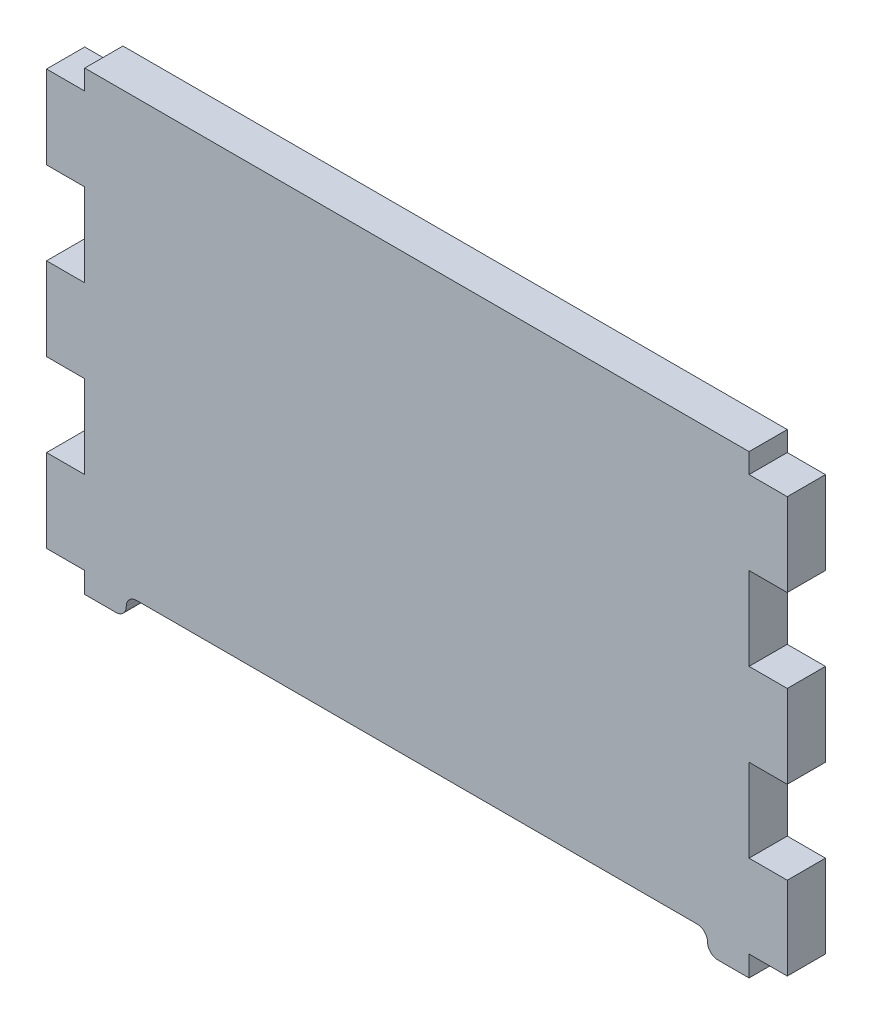
ISO-10303-21;
HEADER;
FILE_DESCRIPTION(('STEP AP214'),'2;1');
FILE_NAME('part.step','',(''),(''),'','','');
FILE_SCHEMA(('AUTOMOTIVE_DESIGN { 1 0 10303 214 1 1 1 1 }'));
ENDSEC;
DATA;
#1=APPLICATION_CONTEXT('core data for automotive mechanical design processes');
#2=APPLICATION_PROTOCOL_DEFINITION('international standard','automotive_design',2000,#1);
#3=PRODUCT_CONTEXT('',#1,'mechanical');
#4=PRODUCT('Part','Part','',(#3));
#5=PRODUCT_RELATED_PRODUCT_CATEGORY('part','',(#4));
#6=PRODUCT_DEFINITION_FORMATION('','',#4);
#7=PRODUCT_DEFINITION_CONTEXT('part definition',#1,'design');
#8=PRODUCT_DEFINITION('design','',#6,#7);
#9=PRODUCT_DEFINITION_SHAPE('','',#8);
#10=(LENGTH_UNIT() NAMED_UNIT(*) SI_UNIT(.MILLI.,.METRE.));
#11=(NAMED_UNIT(*) PLANE_ANGLE_UNIT() SI_UNIT($,.RADIAN.));
#12=(NAMED_UNIT(*) SI_UNIT($,.STERADIAN.) SOLID_ANGLE_UNIT());
#13=UNCERTAINTY_MEASURE_WITH_UNIT(LENGTH_MEASURE(1.E-05),#10,'distance_accuracy_value','');
#14=(GEOMETRIC_REPRESENTATION_CONTEXT(3) GLOBAL_UNCERTAINTY_ASSIGNED_CONTEXT((#13)) GLOBAL_UNIT_ASSIGNED_CONTEXT((#10,
#11,#12)) REPRESENTATION_CONTEXT('',''));
#15=CARTESIAN_POINT('',(0.,0.,0.));
#16=DIRECTION('',(0.,0.,1.));
#17=DIRECTION('',(1.,0.,0.));
#18=AXIS2_PLACEMENT_3D('',#15,#16,#17);
#19=CARTESIAN_POINT('',(0.,44.4500000000001,5.842));
#20=DIRECTION('',(0.,-1.,0.));
#21=DIRECTION('',(0.,0.,-1.));
#22=AXIS2_PLACEMENT_3D('',#19,#20,#21);
#23=PLANE('',#22);
#24=DIRECTION('',(-1.,0.,0.));
#25=VECTOR('',#24,1.);
#26=CARTESIAN_POINT('',(0.,44.4500000000001,0.));
#27=LINE('',#26,#25);
#28=CARTESIAN_POINT('',(56.642,44.4500000000001,0.));
#29=VERTEX_POINT('',#28);
#30=CARTESIAN_POINT('',(50.8,44.4500000000001,0.));
#31=VERTEX_POINT('',#30);
#32=EDGE_CURVE('E281',#29,#31,#27,.T.);
#33=ORIENTED_EDGE('',*,*,#32,.T.);
#34=DIRECTION('',(0.,0.,-1.));
#35=VECTOR('',#34,1.);
#36=CARTESIAN_POINT('',(50.8,44.4500000000001,5.842));
#37=LINE('',#36,#35);
#38=CARTESIAN_POINT('',(50.8,44.4500000000001,5.842));
#39=VERTEX_POINT('',#38);
#40=EDGE_CURVE('E263',#39,#31,#37,.T.);
#41=ORIENTED_EDGE('',*,*,#40,.F.);
#42=DIRECTION('',(-1.,0.,0.));
#43=VECTOR('',#42,1.);
#44=CARTESIAN_POINT('',(0.,44.4500000000001,5.842));
#45=LINE('',#44,#43);
#46=CARTESIAN_POINT('',(56.642,44.4500000000001,5.842));
#47=VERTEX_POINT('',#46);
#48=EDGE_CURVE('E269',#47,#39,#45,.T.);
#49=ORIENTED_EDGE('',*,*,#48,.F.);
#50=DIRECTION('',(0.,0.,-1.));
#51=VECTOR('',#50,1.);
#52=CARTESIAN_POINT('',(56.642,44.4500000000001,5.842));
#53=LINE('',#52,#51);
#54=EDGE_CURVE('E362',#47,#29,#53,.T.);
#55=ORIENTED_EDGE('',*,*,#54,.T.);
#56=EDGE_LOOP('',(#33,#41,#49,#55));
#57=FACE_BOUND('',#56,.T.);
#58=ADVANCED_FACE('F37',(#57),#23,.F.);
#59=CARTESIAN_POINT('',(50.8,0.,5.842));
#60=DIRECTION('',(-1.,0.,0.));
#61=DIRECTION('',(0.,0.,1.));
#62=AXIS2_PLACEMENT_3D('',#59,#60,#61);
#63=PLANE('',#62);
#64=DIRECTION('',(0.,1.,0.));
#65=VECTOR('',#64,1.);
#66=CARTESIAN_POINT('',(50.8,0.,0.));
#67=LINE('',#66,#65);
#68=CARTESIAN_POINT('',(50.8,47.4980000000001,0.));
#69=VERTEX_POINT('',#68);
#70=EDGE_CURVE('E312',#31,#69,#67,.T.);
#71=ORIENTED_EDGE('',*,*,#70,.T.);
#72=DIRECTION('',(0.,0.,-1.));
#73=VECTOR('',#72,1.);
#74=CARTESIAN_POINT('',(50.8,47.4980000000001,5.842));
#75=LINE('',#74,#73);
#76=CARTESIAN_POINT('',(50.8,47.4980000000001,5.842));
#77=VERTEX_POINT('',#76);
#78=EDGE_CURVE('E265',#77,#69,#75,.T.);
#79=ORIENTED_EDGE('',*,*,#78,.F.);
#80=DIRECTION('',(0.,1.,0.));
#81=VECTOR('',#80,1.);
#82=CARTESIAN_POINT('',(50.8,0.,5.842));
#83=LINE('',#82,#81);
#84=EDGE_CURVE('E258',#39,#77,#83,.T.);
#85=ORIENTED_EDGE('',*,*,#84,.F.);
#86=ORIENTED_EDGE('',*,*,#40,.T.);
#87=EDGE_LOOP('',(#71,#79,#85,#86));
#88=FACE_BOUND('',#87,.T.);
#89=ADVANCED_FACE('F261',(#88),#63,.F.);
#90=CARTESIAN_POINT('',(0.,47.4980000000001,5.842));
#91=DIRECTION('',(0.,1.,0.));
#92=DIRECTION('',(-1.,0.,0.));
#93=AXIS2_PLACEMENT_3D('',#90,#91,#92);
#94=PLANE('',#93);
#95=DIRECTION('',(1.,0.,0.));
#96=VECTOR('',#95,1.);
#97=CARTESIAN_POINT('',(0.,47.4980000000001,0.));
#98=LINE('',#97,#96);
#99=CARTESIAN_POINT('',(-50.8,47.4980000000001,0.));
#100=VERTEX_POINT('',#99);
#101=EDGE_CURVE('E365',#100,#69,#98,.T.);
#102=ORIENTED_EDGE('',*,*,#101,.F.);
#103=DIRECTION('',(0.,0.,-1.));
#104=VECTOR('',#103,1.);
#105=CARTESIAN_POINT('',(-50.8,47.4980000000001,5.842));
#106=LINE('',#105,#104);
#107=CARTESIAN_POINT('',(-50.8,47.4980000000001,5.842));
#108=VERTEX_POINT('',#107);
#109=EDGE_CURVE('E287',#108,#100,#106,.T.);
#110=ORIENTED_EDGE('',*,*,#109,.F.);
#111=DIRECTION('',(1.,0.,0.));
#112=VECTOR('',#111,1.);
#113=CARTESIAN_POINT('',(0.,47.4980000000001,5.842));
#114=LINE('',#113,#112);
#115=EDGE_CURVE('E268',#108,#77,#114,.T.);
#116=ORIENTED_EDGE('',*,*,#115,.T.);
#117=ORIENTED_EDGE('',*,*,#78,.T.);
#118=EDGE_LOOP('',(#102,#110,#116,#117));
#119=FACE_BOUND('',#118,.T.);
#120=ADVANCED_FACE('F502',(#119),#94,.T.);
#121=CARTESIAN_POINT('',(-50.8,0.,5.842));
#122=DIRECTION('',(-1.,0.,0.));
#123=DIRECTION('',(0.,0.,1.));
#124=AXIS2_PLACEMENT_3D('',#121,#122,#123);
#125=PLANE('',#124);
#126=DIRECTION('',(0.,1.,0.));
#127=VECTOR('',#126,1.);
#128=CARTESIAN_POINT('',(-50.8,0.,0.));
#129=LINE('',#128,#127);
#130=CARTESIAN_POINT('',(-50.8,44.4500000000001,0.));
#131=VERTEX_POINT('',#130);
#132=EDGE_CURVE('E368',#131,#100,#129,.T.);
#133=ORIENTED_EDGE('',*,*,#132,.F.);
#134=DIRECTION('',(0.,0.,-1.));
#135=VECTOR('',#134,1.);
#136=CARTESIAN_POINT('',(-50.8,44.4500000000001,5.842));
#137=LINE('',#136,#135);
#138=CARTESIAN_POINT('',(-50.8,44.4500000000001,5.842));
#139=VERTEX_POINT('',#138);
#140=EDGE_CURVE('E493',#139,#131,#137,.T.);
#141=ORIENTED_EDGE('',*,*,#140,.F.);
#142=DIRECTION('',(0.,1.,0.));
#143=VECTOR('',#142,1.);
#144=CARTESIAN_POINT('',(-50.8,0.,5.842));
#145=LINE('',#144,#143);
#146=EDGE_CURVE('E500',#139,#108,#145,.T.);
#147=ORIENTED_EDGE('',*,*,#146,.T.);
#148=ORIENTED_EDGE('',*,*,#109,.T.);
#149=EDGE_LOOP('',(#133,#141,#147,#148));
#150=FACE_BOUND('',#149,.T.);
#151=ADVANCED_FACE('F498',(#150),#125,.T.);
#152=CARTESIAN_POINT('',(0.,44.4500000000001,5.842));
#153=DIRECTION('',(0.,1.,0.));
#154=DIRECTION('',(0.,0.,1.));
#155=AXIS2_PLACEMENT_3D('',#152,#153,#154);
#156=PLANE('',#155);
#157=DIRECTION('',(1.,0.,0.));
#158=VECTOR('',#157,1.);
#159=CARTESIAN_POINT('',(0.,44.4500000000001,0.));
#160=LINE('',#159,#158);
#161=CARTESIAN_POINT('',(-56.642,44.4500000000001,0.));
#162=VERTEX_POINT('',#161);
#163=EDGE_CURVE('E371',#162,#131,#160,.T.);
#164=ORIENTED_EDGE('',*,*,#163,.F.);
#165=DIRECTION('',(0.,0.,-1.));
#166=VECTOR('',#165,1.);
#167=CARTESIAN_POINT('',(-56.642,44.4500000000001,5.842));
#168=LINE('',#167,#166);
#169=CARTESIAN_POINT('',(-56.642,44.4500000000001,5.842));
#170=VERTEX_POINT('',#169);
#171=EDGE_CURVE('E491',#170,#162,#168,.T.);
#172=ORIENTED_EDGE('',*,*,#171,.F.);
#173=DIRECTION('',(1.,0.,0.));
#174=VECTOR('',#173,1.);
#175=CARTESIAN_POINT('',(0.,44.4500000000001,5.842));
#176=LINE('',#175,#174);
#177=EDGE_CURVE('E513',#170,#139,#176,.T.);
#178=ORIENTED_EDGE('',*,*,#177,.T.);
#179=ORIENTED_EDGE('',*,*,#140,.T.);
#180=EDGE_LOOP('',(#164,#172,#178,#179));
#181=FACE_BOUND('',#180,.T.);
#182=ADVANCED_FACE('F509',(#181),#156,.T.);
#183=CARTESIAN_POINT('',(-56.642,0.,5.842));
#184=DIRECTION('',(1.,0.,0.));
#185=DIRECTION('',(0.,0.,-1.));
#186=AXIS2_PLACEMENT_3D('',#183,#184,#185);
#187=PLANE('',#186);
#188=DIRECTION('',(0.,-1.,0.));
#189=VECTOR('',#188,1.);
#190=CARTESIAN_POINT('',(-56.642,0.,0.));
#191=LINE('',#190,#189);
#192=CARTESIAN_POINT('',(-56.642,31.7500000000001,0.));
#193=VERTEX_POINT('',#192);
#194=EDGE_CURVE('E374',#162,#193,#191,.T.);
#195=ORIENTED_EDGE('',*,*,#194,.T.);
#196=DIRECTION('',(0.,0.,-1.));
#197=VECTOR('',#196,1.);
#198=CARTESIAN_POINT('',(-56.642,31.7500000000001,5.842));
#199=LINE('',#198,#197);
#200=CARTESIAN_POINT('',(-56.642,31.7500000000001,5.842));
#201=VERTEX_POINT('',#200);
#202=EDGE_CURVE('E488',#201,#193,#199,.T.);
#203=ORIENTED_EDGE('',*,*,#202,.F.);
#204=DIRECTION('',(0.,-1.,0.));
#205=VECTOR('',#204,1.);
#206=CARTESIAN_POINT('',(-56.642,0.,5.842));
#207=LINE('',#206,#205);
#208=EDGE_CURVE('E515',#170,#201,#207,.T.);
#209=ORIENTED_EDGE('',*,*,#208,.F.);
#210=ORIENTED_EDGE('',*,*,#171,.T.);
#211=EDGE_LOOP('',(#195,#203,#209,#210));
#212=FACE_BOUND('',#211,.T.);
#213=ADVANCED_FACE('F882',(#212),#187,.F.);
#214=CARTESIAN_POINT('',(0.,31.7500000000001,5.842));
#215=DIRECTION('',(0.,1.,0.));
#216=DIRECTION('',(0.,0.,1.));
#217=AXIS2_PLACEMENT_3D('',#214,#215,#216);
#218=PLANE('',#217);
#219=DIRECTION('',(1.,0.,0.));
#220=VECTOR('',#219,1.);
#221=CARTESIAN_POINT('',(0.,31.7500000000001,0.));
#222=LINE('',#221,#220);
#223=CARTESIAN_POINT('',(-50.8,31.7500000000001,0.));
#224=VERTEX_POINT('',#223);
#225=EDGE_CURVE('E376',#193,#224,#222,.T.);
#226=ORIENTED_EDGE('',*,*,#225,.T.);
#227=DIRECTION('',(0.,0.,-1.));
#228=VECTOR('',#227,1.);
#229=CARTESIAN_POINT('',(-50.8,31.7500000000001,5.842));
#230=LINE('',#229,#228);
#231=CARTESIAN_POINT('',(-50.8,31.7500000000001,5.842));
#232=VERTEX_POINT('',#231);
#233=EDGE_CURVE('E486',#232,#224,#230,.T.);
#234=ORIENTED_EDGE('',*,*,#233,.F.);
#235=DIRECTION('',(1.,0.,0.));
#236=VECTOR('',#235,1.);
#237=CARTESIAN_POINT('',(0.,31.7500000000001,5.842));
#238=LINE('',#237,#236);
#239=EDGE_CURVE('E520',#201,#232,#238,.T.);
#240=ORIENTED_EDGE('',*,*,#239,.F.);
#241=ORIENTED_EDGE('',*,*,#202,.T.);
#242=EDGE_LOOP('',(#226,#234,#240,#241));
#243=FACE_BOUND('',#242,.T.);
#244=ADVANCED_FACE('F872',(#243),#218,.F.);
#245=CARTESIAN_POINT('',(-50.8,0.,5.842));
#246=DIRECTION('',(-1.,0.,0.));
#247=DIRECTION('',(0.,0.,1.));
#248=AXIS2_PLACEMENT_3D('',#245,#246,#247);
#249=PLANE('',#248);
#250=DIRECTION('',(0.,1.,0.));
#251=VECTOR('',#250,1.);
#252=CARTESIAN_POINT('',(-50.8,0.,0.));
#253=LINE('',#252,#251);
#254=CARTESIAN_POINT('',(-50.8,19.05,0.));
#255=VERTEX_POINT('',#254);
#256=EDGE_CURVE('E379',#255,#224,#253,.T.);
#257=ORIENTED_EDGE('',*,*,#256,.F.);
#258=DIRECTION('',(0.,0.,-1.));
#259=VECTOR('',#258,1.);
#260=CARTESIAN_POINT('',(-50.8,19.05,5.842));
#261=LINE('',#260,#259);
#262=CARTESIAN_POINT('',(-50.8,19.05,5.842));
#263=VERTEX_POINT('',#262);
#264=EDGE_CURVE('E484',#263,#255,#261,.T.);
#265=ORIENTED_EDGE('',*,*,#264,.F.);
#266=DIRECTION('',(0.,1.,0.));
#267=VECTOR('',#266,1.);
#268=CARTESIAN_POINT('',(-50.8,0.,5.842));
#269=LINE('',#268,#267);
#270=EDGE_CURVE('E522',#263,#232,#269,.T.);
#271=ORIENTED_EDGE('',*,*,#270,.T.);
#272=ORIENTED_EDGE('',*,*,#233,.T.);
#273=EDGE_LOOP('',(#257,#265,#271,#272));
#274=FACE_BOUND('',#273,.T.);
#275=ADVANCED_FACE('F862',(#274),#249,.T.);
#276=CARTESIAN_POINT('',(0.,19.05,5.842));
#277=DIRECTION('',(0.,1.,0.));
#278=DIRECTION('',(0.,0.,1.));
#279=AXIS2_PLACEMENT_3D('',#276,#277,#278);
#280=PLANE('',#279);
#281=DIRECTION('',(1.,0.,0.));
#282=VECTOR('',#281,1.);
#283=CARTESIAN_POINT('',(0.,19.05,0.));
#284=LINE('',#283,#282);
#285=CARTESIAN_POINT('',(-56.642,19.05,0.));
#286=VERTEX_POINT('',#285);
#287=EDGE_CURVE('E382',#286,#255,#284,.T.);
#288=ORIENTED_EDGE('',*,*,#287,.F.);
#289=DIRECTION('',(0.,0.,-1.));
#290=VECTOR('',#289,1.);
#291=CARTESIAN_POINT('',(-56.642,19.05,5.842));
#292=LINE('',#291,#290);
#293=CARTESIAN_POINT('',(-56.642,19.05,5.842));
#294=VERTEX_POINT('',#293);
#295=EDGE_CURVE('E482',#294,#286,#292,.T.);
#296=ORIENTED_EDGE('',*,*,#295,.F.);
#297=DIRECTION('',(1.,0.,0.));
#298=VECTOR('',#297,1.);
#299=CARTESIAN_POINT('',(0.,19.05,5.842));
#300=LINE('',#299,#298);
#301=EDGE_CURVE('E525',#294,#263,#300,.T.);
#302=ORIENTED_EDGE('',*,*,#301,.T.);
#303=ORIENTED_EDGE('',*,*,#264,.T.);
#304=EDGE_LOOP('',(#288,#296,#302,#303));
#305=FACE_BOUND('',#304,.T.);
#306=ADVANCED_FACE('F852',(#305),#280,.T.);
#307=CARTESIAN_POINT('',(-56.642,0.,5.842));
#308=DIRECTION('',(-1.,0.,0.));
#309=DIRECTION('',(0.,0.,1.));
#310=AXIS2_PLACEMENT_3D('',#307,#308,#309);
#311=PLANE('',#310);
#312=DIRECTION('',(0.,1.,0.));
#313=VECTOR('',#312,1.);
#314=CARTESIAN_POINT('',(-56.642,0.,0.));
#315=LINE('',#314,#313);
#316=CARTESIAN_POINT('',(-56.642,6.35,0.));
#317=VERTEX_POINT('',#316);
#318=EDGE_CURVE('E385',#317,#286,#315,.T.);
#319=ORIENTED_EDGE('',*,*,#318,.F.);
#320=DIRECTION('',(0.,0.,-1.));
#321=VECTOR('',#320,1.);
#322=CARTESIAN_POINT('',(-56.642,6.35,5.842));
#323=LINE('',#322,#321);
#324=CARTESIAN_POINT('',(-56.642,6.35,5.842));
#325=VERTEX_POINT('',#324);
#326=EDGE_CURVE('E480',#325,#317,#323,.T.);
#327=ORIENTED_EDGE('',*,*,#326,.F.);
#328=DIRECTION('',(0.,1.,0.));
#329=VECTOR('',#328,1.);
#330=CARTESIAN_POINT('',(-56.642,0.,5.842));
#331=LINE('',#330,#329);
#332=EDGE_CURVE('E528',#325,#294,#331,.T.);
#333=ORIENTED_EDGE('',*,*,#332,.T.);
#334=ORIENTED_EDGE('',*,*,#295,.T.);
#335=EDGE_LOOP('',(#319,#327,#333,#334));
#336=FACE_BOUND('',#335,.T.);
#337=ADVANCED_FACE('F842',(#336),#311,.T.);
#338=CARTESIAN_POINT('',(0.,6.35,5.842));
#339=DIRECTION('',(0.,1.,0.));
#340=DIRECTION('',(0.,0.,1.));
#341=AXIS2_PLACEMENT_3D('',#338,#339,#340);
#342=PLANE('',#341);
#343=DIRECTION('',(1.,0.,0.));
#344=VECTOR('',#343,1.);
#345=CARTESIAN_POINT('',(0.,6.35,0.));
#346=LINE('',#345,#344);
#347=CARTESIAN_POINT('',(-50.8,6.35,0.));
#348=VERTEX_POINT('',#347);
#349=EDGE_CURVE('E388',#317,#348,#346,.T.);
#350=ORIENTED_EDGE('',*,*,#349,.T.);
#351=DIRECTION('',(0.,0.,-1.));
#352=VECTOR('',#351,1.);
#353=CARTESIAN_POINT('',(-50.8,6.35,5.842));
#354=LINE('',#353,#352);
#355=CARTESIAN_POINT('',(-50.8,6.35,5.842));
#356=VERTEX_POINT('',#355);
#357=EDGE_CURVE('E478',#356,#348,#354,.T.);
#358=ORIENTED_EDGE('',*,*,#357,.F.);
#359=DIRECTION('',(1.,0.,0.));
#360=VECTOR('',#359,1.);
#361=CARTESIAN_POINT('',(0.,6.35,5.842));
#362=LINE('',#361,#360);
#363=EDGE_CURVE('E531',#325,#356,#362,.T.);
#364=ORIENTED_EDGE('',*,*,#363,.F.);
#365=ORIENTED_EDGE('',*,*,#326,.T.);
#366=EDGE_LOOP('',(#350,#358,#364,#365));
#367=FACE_BOUND('',#366,.T.);
#368=ADVANCED_FACE('F832',(#367),#342,.F.);
#369=CARTESIAN_POINT('',(-50.8,0.,5.842));
#370=DIRECTION('',(-1.,0.,0.));
#371=DIRECTION('',(0.,0.,1.));
#372=AXIS2_PLACEMENT_3D('',#369,#370,#371);
#373=PLANE('',#372);
#374=DIRECTION('',(0.,1.,0.));
#375=VECTOR('',#374,1.);
#376=CARTESIAN_POINT('',(-50.8,0.,0.));
#377=LINE('',#376,#375);
#378=CARTESIAN_POINT('',(-50.8,-6.35,0.));
#379=VERTEX_POINT('',#378);
#380=EDGE_CURVE('E391',#379,#348,#377,.T.);
#381=ORIENTED_EDGE('',*,*,#380,.F.);
#382=DIRECTION('',(0.,0.,-1.));
#383=VECTOR('',#382,1.);
#384=CARTESIAN_POINT('',(-50.8,-6.35,5.842));
#385=LINE('',#384,#383);
#386=CARTESIAN_POINT('',(-50.8,-6.35,5.842));
#387=VERTEX_POINT('',#386);
#388=EDGE_CURVE('E476',#387,#379,#385,.T.);
#389=ORIENTED_EDGE('',*,*,#388,.F.);
#390=DIRECTION('',(0.,1.,0.));
#391=VECTOR('',#390,1.);
#392=CARTESIAN_POINT('',(-50.8,0.,5.842));
#393=LINE('',#392,#391);
#394=EDGE_CURVE('E533',#387,#356,#393,.T.);
#395=ORIENTED_EDGE('',*,*,#394,.T.);
#396=ORIENTED_EDGE('',*,*,#357,.T.);
#397=EDGE_LOOP('',(#381,#389,#395,#396));
#398=FACE_BOUND('',#397,.T.);
#399=ADVANCED_FACE('F822',(#398),#373,.T.);
#400=CARTESIAN_POINT('',(0.,-6.35,5.842));
#401=DIRECTION('',(0.,1.,0.));
#402=DIRECTION('',(0.,0.,1.));
#403=AXIS2_PLACEMENT_3D('',#400,#401,#402);
#404=PLANE('',#403);
#405=DIRECTION('',(1.,0.,0.));
#406=VECTOR('',#405,1.);
#407=CARTESIAN_POINT('',(0.,-6.35,0.));
#408=LINE('',#407,#406);
#409=CARTESIAN_POINT('',(-56.642,-6.35,0.));
#410=VERTEX_POINT('',#409);
#411=EDGE_CURVE('E394',#410,#379,#408,.T.);
#412=ORIENTED_EDGE('',*,*,#411,.F.);
#413=DIRECTION('',(0.,0.,-1.));
#414=VECTOR('',#413,1.);
#415=CARTESIAN_POINT('',(-56.642,-6.35,5.842));
#416=LINE('',#415,#414);
#417=CARTESIAN_POINT('',(-56.642,-6.35,5.842));
#418=VERTEX_POINT('',#417);
#419=EDGE_CURVE('E474',#418,#410,#416,.T.);
#420=ORIENTED_EDGE('',*,*,#419,.F.);
#421=DIRECTION('',(1.,0.,0.));
#422=VECTOR('',#421,1.);
#423=CARTESIAN_POINT('',(0.,-6.35,5.842));
#424=LINE('',#423,#422);
#425=EDGE_CURVE('E536',#418,#387,#424,.T.);
#426=ORIENTED_EDGE('',*,*,#425,.T.);
#427=ORIENTED_EDGE('',*,*,#388,.T.);
#428=EDGE_LOOP('',(#412,#420,#426,#427));
#429=FACE_BOUND('',#428,.T.);
#430=ADVANCED_FACE('F812',(#429),#404,.T.);
#431=CARTESIAN_POINT('',(-56.642,0.,5.842));
#432=DIRECTION('',(1.,0.,0.));
#433=DIRECTION('',(0.,0.,-1.));
#434=AXIS2_PLACEMENT_3D('',#431,#432,#433);
#435=PLANE('',#434);
#436=DIRECTION('',(0.,-1.,0.));
#437=VECTOR('',#436,1.);
#438=CARTESIAN_POINT('',(-56.642,0.,0.));
#439=LINE('',#438,#437);
#440=CARTESIAN_POINT('',(-56.642,-19.05,0.));
#441=VERTEX_POINT('',#440);
#442=EDGE_CURVE('E397',#410,#441,#439,.T.);
#443=ORIENTED_EDGE('',*,*,#442,.T.);
#444=DIRECTION('',(0.,0.,-1.));
#445=VECTOR('',#444,1.);
#446=CARTESIAN_POINT('',(-56.642,-19.05,5.842));
#447=LINE('',#446,#445);
#448=CARTESIAN_POINT('',(-56.642,-19.05,5.842));
#449=VERTEX_POINT('',#448);
#450=EDGE_CURVE('E471',#449,#441,#447,.T.);
#451=ORIENTED_EDGE('',*,*,#450,.F.);
#452=DIRECTION('',(0.,-1.,0.));
#453=VECTOR('',#452,1.);
#454=CARTESIAN_POINT('',(-56.642,0.,5.842));
#455=LINE('',#454,#453);
#456=EDGE_CURVE('E539',#418,#449,#455,.T.);
#457=ORIENTED_EDGE('',*,*,#456,.F.);
#458=ORIENTED_EDGE('',*,*,#419,.T.);
#459=EDGE_LOOP('',(#443,#451,#457,#458));
#460=FACE_BOUND('',#459,.T.);
#461=ADVANCED_FACE('F803',(#460),#435,.F.);
#462=CARTESIAN_POINT('',(0.,-19.05,5.842));
#463=DIRECTION('',(0.,1.,0.));
#464=DIRECTION('',(0.,0.,1.));
#465=AXIS2_PLACEMENT_3D('',#462,#463,#464);
#466=PLANE('',#465);
#467=DIRECTION('',(1.,0.,0.));
#468=VECTOR('',#467,1.);
#469=CARTESIAN_POINT('',(0.,-19.05,0.));
#470=LINE('',#469,#468);
#471=CARTESIAN_POINT('',(-50.8,-19.05,0.));
#472=VERTEX_POINT('',#471);
#473=EDGE_CURVE('E399',#441,#472,#470,.T.);
#474=ORIENTED_EDGE('',*,*,#473,.T.);
#475=DIRECTION('',(0.,0.,-1.));
#476=VECTOR('',#475,1.);
#477=CARTESIAN_POINT('',(-50.8,-19.05,5.842));
#478=LINE('',#477,#476);
#479=CARTESIAN_POINT('',(-50.8,-19.05,5.842));
#480=VERTEX_POINT('',#479);
#481=EDGE_CURVE('E469',#480,#472,#478,.T.);
#482=ORIENTED_EDGE('',*,*,#481,.F.);
#483=DIRECTION('',(1.,0.,0.));
#484=VECTOR('',#483,1.);
#485=CARTESIAN_POINT('',(0.,-19.05,5.842));
#486=LINE('',#485,#484);
#487=EDGE_CURVE('E541',#449,#480,#486,.T.);
#488=ORIENTED_EDGE('',*,*,#487,.F.);
#489=ORIENTED_EDGE('',*,*,#450,.T.);
#490=EDGE_LOOP('',(#474,#482,#488,#489));
#491=FACE_BOUND('',#490,.T.);
#492=ADVANCED_FACE('F560',(#491),#466,.F.);
#493=CARTESIAN_POINT('',(-50.8,-1.11022302462516E-13,5.842));
#494=DIRECTION('',(-1.,0.,0.));
#495=DIRECTION('',(0.,-1.,0.));
#496=AXIS2_PLACEMENT_3D('',#493,#494,#495);
#497=PLANE('',#496);
#498=DIRECTION('',(0.,1.,0.));
#499=VECTOR('',#498,1.);
#500=CARTESIAN_POINT('',(-50.8,-1.11022302462516E-13,0.));
#501=LINE('',#500,#499);
#502=CARTESIAN_POINT('',(-50.8,-22.225,0.));
#503=VERTEX_POINT('',#502);
#504=EDGE_CURVE('E402',#503,#472,#501,.T.);
#505=ORIENTED_EDGE('',*,*,#504,.F.);
#506=DIRECTION('',(0.,0.,-1.));
#507=VECTOR('',#506,1.);
#508=CARTESIAN_POINT('',(-50.8,-22.225,5.842));
#509=LINE('',#508,#507);
#510=CARTESIAN_POINT('',(-50.8,-22.225,5.842));
#511=VERTEX_POINT('',#510);
#512=EDGE_CURVE('E466',#511,#503,#509,.T.);
#513=ORIENTED_EDGE('',*,*,#512,.F.);
#514=DIRECTION('',(0.,1.,0.));
#515=VECTOR('',#514,1.);
#516=CARTESIAN_POINT('',(-50.8,-1.11022302462516E-13,5.842));
#517=LINE('',#516,#515);
#518=EDGE_CURVE('E543',#511,#480,#517,.T.);
#519=ORIENTED_EDGE('',*,*,#518,.T.);
#520=ORIENTED_EDGE('',*,*,#481,.T.);
#521=EDGE_LOOP('',(#505,#513,#519,#520));
#522=FACE_BOUND('',#521,.T.);
#523=ADVANCED_FACE('F553',(#522),#497,.T.);
#524=CARTESIAN_POINT('',(0.,-22.225,5.842));
#525=DIRECTION('',(0.,-1.,0.));
#526=DIRECTION('',(0.,0.,-1.));
#527=AXIS2_PLACEMENT_3D('',#524,#525,#526);
#528=PLANE('',#527);
#529=DIRECTION('',(-1.,0.,0.));
#530=VECTOR('',#529,1.);
#531=CARTESIAN_POINT('',(0.,-22.225,0.));
#532=LINE('',#531,#530);
#533=CARTESIAN_POINT('',(-46.0375,-22.225,0.));
#534=VERTEX_POINT('',#533);
#535=EDGE_CURVE('E405',#534,#503,#532,.T.);
#536=ORIENTED_EDGE('',*,*,#535,.F.);
#537=DIRECTION('',(0.,0.,-1.));
#538=VECTOR('',#537,1.);
#539=CARTESIAN_POINT('',(-46.0375,-22.225,5.842));
#540=LINE('',#539,#538);
#541=CARTESIAN_POINT('',(-46.0375,-22.225,5.842));
#542=VERTEX_POINT('',#541);
#543=EDGE_CURVE('E302',#534,#542,#540,.F.);
#544=ORIENTED_EDGE('',*,*,#543,.T.);
#545=DIRECTION('',(-1.,0.,0.));
#546=VECTOR('',#545,1.);
#547=CARTESIAN_POINT('',(0.,-22.225,5.842));
#548=LINE('',#547,#546);
#549=EDGE_CURVE('E337',#542,#511,#548,.T.);
#550=ORIENTED_EDGE('',*,*,#549,.T.);
#551=ORIENTED_EDGE('',*,*,#512,.T.);
#552=EDGE_LOOP('',(#536,#544,#550,#551));
#553=FACE_BOUND('',#552,.T.);
#554=ADVANCED_FACE('F548',(#553),#528,.T.);
#555=CARTESIAN_POINT('',(0.,-19.05,5.842));
#556=DIRECTION('',(0.,1.,0.));
#557=DIRECTION('',(-1.,0.,0.));
#558=AXIS2_PLACEMENT_3D('',#555,#556,#557);
#559=PLANE('',#558);
#560=DIRECTION('',(1.,0.,0.));
#561=VECTOR('',#560,1.);
#562=CARTESIAN_POINT('',(0.,-19.05,5.842));
#563=LINE('',#562,#561);
#564=CARTESIAN_POINT('',(-42.8625,-19.05,5.842));
#565=VERTEX_POINT('',#564);
#566=CARTESIAN_POINT('',(42.8625,-19.05,5.842));
#567=VERTEX_POINT('',#566);
#568=EDGE_CURVE('E333',#565,#567,#563,.T.);
#569=ORIENTED_EDGE('',*,*,#568,.F.);
#570=DIRECTION('',(0.,0.,-1.));
#571=VECTOR('',#570,1.);
#572=CARTESIAN_POINT('',(-42.8625,-19.05,5.842));
#573=LINE('',#572,#571);
#574=CARTESIAN_POINT('',(-42.8625,-19.05,0.));
#575=VERTEX_POINT('',#574);
#576=EDGE_CURVE('E285',#565,#575,#573,.T.);
#577=ORIENTED_EDGE('',*,*,#576,.T.);
#578=DIRECTION('',(1.,0.,0.));
#579=VECTOR('',#578,1.);
#580=CARTESIAN_POINT('',(0.,-19.05,0.));
#581=LINE('',#580,#579);
#582=CARTESIAN_POINT('',(42.8625,-19.05,0.));
#583=VERTEX_POINT('',#582);
#584=EDGE_CURVE('E407',#575,#583,#581,.T.);
#585=ORIENTED_EDGE('',*,*,#584,.T.);
#586=DIRECTION('',(0.,0.,-1.));
#587=VECTOR('',#586,1.);
#588=CARTESIAN_POINT('',(42.8625,-19.05,5.842));
#589=LINE('',#588,#587);
#590=EDGE_CURVE('E282',#583,#567,#589,.F.);
#591=ORIENTED_EDGE('',*,*,#590,.T.);
#592=EDGE_LOOP('',(#569,#577,#585,#591));
#593=FACE_BOUND('',#592,.T.);
#594=ADVANCED_FACE('F570',(#593),#559,.F.);
#595=CARTESIAN_POINT('',(0.,-22.2249999999999,5.842));
#596=DIRECTION('',(0.,-1.,0.));
#597=DIRECTION('',(1.,0.,0.));
#598=AXIS2_PLACEMENT_3D('',#595,#596,#597);
#599=PLANE('',#598);
#600=DIRECTION('',(-1.,0.,0.));
#601=VECTOR('',#600,1.);
#602=CARTESIAN_POINT('',(0.,-22.2249999999999,5.842));
#603=LINE('',#602,#601);
#604=CARTESIAN_POINT('',(50.8,-22.225,5.842));
#605=VERTEX_POINT('',#604);
#606=CARTESIAN_POINT('',(46.0375,-22.225,5.842));
#607=VERTEX_POINT('',#606);
#608=EDGE_CURVE('E325',#605,#607,#603,.T.);
#609=ORIENTED_EDGE('',*,*,#608,.T.);
#610=DIRECTION('',(0.,0.,-1.));
#611=VECTOR('',#610,1.);
#612=CARTESIAN_POINT('',(46.0375,-22.225,0.));
#613=LINE('',#612,#611);
#614=CARTESIAN_POINT('',(46.0375,-22.225,0.));
#615=VERTEX_POINT('',#614);
#616=EDGE_CURVE('E293',#607,#615,#613,.T.);
#617=ORIENTED_EDGE('',*,*,#616,.T.);
#618=DIRECTION('',(-1.,0.,0.));
#619=VECTOR('',#618,1.);
#620=CARTESIAN_POINT('',(0.,-22.2249999999999,0.));
#621=LINE('',#620,#619);
#622=CARTESIAN_POINT('',(50.8,-22.225,0.));
#623=VERTEX_POINT('',#622);
#624=EDGE_CURVE('E410',#623,#615,#621,.T.);
#625=ORIENTED_EDGE('',*,*,#624,.F.);
#626=DIRECTION('',(0.,0.,-1.));
#627=VECTOR('',#626,1.);
#628=CARTESIAN_POINT('',(50.8,-22.225,5.842));
#629=LINE('',#628,#627);
#630=EDGE_CURVE('E330',#605,#623,#629,.T.);
#631=ORIENTED_EDGE('',*,*,#630,.F.);
#632=EDGE_LOOP('',(#609,#617,#625,#631));
#633=FACE_BOUND('',#632,.T.);
#634=ADVANCED_FACE('F327',(#633),#599,.T.);
#635=CARTESIAN_POINT('',(50.8000000000001,-3.33066907387546E-13,5.842));
#636=DIRECTION('',(-1.,0.,0.));
#637=DIRECTION('',(0.,-1.,0.));
#638=AXIS2_PLACEMENT_3D('',#635,#636,#637);
#639=PLANE('',#638);
#640=DIRECTION('',(0.,1.,0.));
#641=VECTOR('',#640,1.);
#642=CARTESIAN_POINT('',(50.8000000000001,-3.33066907387546E-13,0.));
#643=LINE('',#642,#641);
#644=CARTESIAN_POINT('',(50.8,-19.05,0.));
#645=VERTEX_POINT('',#644);
#646=EDGE_CURVE('E412',#623,#645,#643,.T.);
#647=ORIENTED_EDGE('',*,*,#646,.T.);
#648=DIRECTION('',(0.,0.,-1.));
#649=VECTOR('',#648,1.);
#650=CARTESIAN_POINT('',(50.8,-19.05,5.842));
#651=LINE('',#650,#649);
#652=CARTESIAN_POINT('',(50.8,-19.05,5.842));
#653=VERTEX_POINT('',#652);
#654=EDGE_CURVE('E463',#653,#645,#651,.T.);
#655=ORIENTED_EDGE('',*,*,#654,.F.);
#656=DIRECTION('',(0.,1.,0.));
#657=VECTOR('',#656,1.);
#658=CARTESIAN_POINT('',(50.8000000000001,-3.33066907387546E-13,5.842));
#659=LINE('',#658,#657);
#660=EDGE_CURVE('E332',#605,#653,#659,.T.);
#661=ORIENTED_EDGE('',*,*,#660,.F.);
#662=ORIENTED_EDGE('',*,*,#630,.T.);
#663=EDGE_LOOP('',(#647,#655,#661,#662));
#664=FACE_BOUND('',#663,.T.);
#665=ADVANCED_FACE('F576',(#664),#639,.F.);
#666=CARTESIAN_POINT('',(0.,-19.05,5.842));
#667=DIRECTION('',(0.,-1.,0.));
#668=DIRECTION('',(0.,0.,-1.));
#669=AXIS2_PLACEMENT_3D('',#666,#667,#668);
#670=PLANE('',#669);
#671=DIRECTION('',(-1.,0.,0.));
#672=VECTOR('',#671,1.);
#673=CARTESIAN_POINT('',(0.,-19.05,0.));
#674=LINE('',#673,#672);
#675=CARTESIAN_POINT('',(56.642,-19.05,0.));
#676=VERTEX_POINT('',#675);
#677=EDGE_CURVE('E415',#676,#645,#674,.T.);
#678=ORIENTED_EDGE('',*,*,#677,.F.);
#679=DIRECTION('',(0.,0.,-1.));
#680=VECTOR('',#679,1.);
#681=CARTESIAN_POINT('',(56.642,-19.05,5.842));
#682=LINE('',#681,#680);
#683=CARTESIAN_POINT('',(56.642,-19.05,5.842));
#684=VERTEX_POINT('',#683);
#685=EDGE_CURVE('E461',#684,#676,#682,.T.);
#686=ORIENTED_EDGE('',*,*,#685,.F.);
#687=DIRECTION('',(-1.,0.,0.));
#688=VECTOR('',#687,1.);
#689=CARTESIAN_POINT('',(0.,-19.05,5.842));
#690=LINE('',#689,#688);
#691=EDGE_CURVE('E335',#684,#653,#690,.T.);
#692=ORIENTED_EDGE('',*,*,#691,.T.);
#693=ORIENTED_EDGE('',*,*,#654,.T.);
#694=EDGE_LOOP('',(#678,#686,#692,#693));
#695=FACE_BOUND('',#694,.T.);
#696=ADVANCED_FACE('F773',(#695),#670,.T.);
#697=CARTESIAN_POINT('',(56.642,0.,5.842));
#698=DIRECTION('',(1.,0.,0.));
#699=DIRECTION('',(0.,0.,-1.));
#700=AXIS2_PLACEMENT_3D('',#697,#698,#699);
#701=PLANE('',#700);
#702=DIRECTION('',(0.,-1.,0.));
#703=VECTOR('',#702,1.);
#704=CARTESIAN_POINT('',(56.642,0.,0.));
#705=LINE('',#704,#703);
#706=CARTESIAN_POINT('',(56.642,-6.34999999999998,0.));
#707=VERTEX_POINT('',#706);
#708=EDGE_CURVE('E418',#707,#676,#705,.T.);
#709=ORIENTED_EDGE('',*,*,#708,.F.);
#710=DIRECTION('',(0.,0.,-1.));
#711=VECTOR('',#710,1.);
#712=CARTESIAN_POINT('',(56.642,-6.34999999999998,5.842));
#713=LINE('',#712,#711);
#714=CARTESIAN_POINT('',(56.642,-6.34999999999998,5.842));
#715=VERTEX_POINT('',#714);
#716=EDGE_CURVE('E459',#715,#707,#713,.T.);
#717=ORIENTED_EDGE('',*,*,#716,.F.);
#718=DIRECTION('',(0.,-1.,0.));
#719=VECTOR('',#718,1.);
#720=CARTESIAN_POINT('',(56.642,0.,5.842));
#721=LINE('',#720,#719);
#722=EDGE_CURVE('E343',#715,#684,#721,.T.);
#723=ORIENTED_EDGE('',*,*,#722,.T.);
#724=ORIENTED_EDGE('',*,*,#685,.T.);
#725=EDGE_LOOP('',(#709,#717,#723,#724));
#726=FACE_BOUND('',#725,.T.);
#727=ADVANCED_FACE('F582',(#726),#701,.T.);
#728=CARTESIAN_POINT('',(0.,-6.34999999999998,5.842));
#729=DIRECTION('',(0.,-1.,0.));
#730=DIRECTION('',(0.,0.,-1.));
#731=AXIS2_PLACEMENT_3D('',#728,#729,#730);
#732=PLANE('',#731);
#733=DIRECTION('',(-1.,0.,0.));
#734=VECTOR('',#733,1.);
#735=CARTESIAN_POINT('',(0.,-6.34999999999998,0.));
#736=LINE('',#735,#734);
#737=CARTESIAN_POINT('',(50.8,-6.34999999999998,0.));
#738=VERTEX_POINT('',#737);
#739=EDGE_CURVE('E421',#707,#738,#736,.T.);
#740=ORIENTED_EDGE('',*,*,#739,.T.);
#741=DIRECTION('',(0.,0.,-1.));
#742=VECTOR('',#741,1.);
#743=CARTESIAN_POINT('',(50.8,-6.34999999999998,5.842));
#744=LINE('',#743,#742);
#745=CARTESIAN_POINT('',(50.8,-6.34999999999998,5.842));
#746=VERTEX_POINT('',#745);
#747=EDGE_CURVE('E456',#746,#738,#744,.T.);
#748=ORIENTED_EDGE('',*,*,#747,.F.);
#749=DIRECTION('',(-1.,0.,0.));
#750=VECTOR('',#749,1.);
#751=CARTESIAN_POINT('',(0.,-6.34999999999998,5.842));
#752=LINE('',#751,#750);
#753=EDGE_CURVE('E346',#715,#746,#752,.T.);
#754=ORIENTED_EDGE('',*,*,#753,.F.);
#755=ORIENTED_EDGE('',*,*,#716,.T.);
#756=EDGE_LOOP('',(#740,#748,#754,#755));
#757=FACE_BOUND('',#756,.T.);
#758=ADVANCED_FACE('F587',(#757),#732,.F.);
#759=CARTESIAN_POINT('',(50.8,0.,5.842));
#760=DIRECTION('',(-1.,0.,0.));
#761=DIRECTION('',(0.,-1.,0.));
#762=AXIS2_PLACEMENT_3D('',#759,#760,#761);
#763=PLANE('',#762);
#764=DIRECTION('',(0.,1.,0.));
#765=VECTOR('',#764,1.);
#766=CARTESIAN_POINT('',(50.8,0.,0.));
#767=LINE('',#766,#765);
#768=CARTESIAN_POINT('',(50.8,6.35000000000001,0.));
#769=VERTEX_POINT('',#768);
#770=EDGE_CURVE('E423',#738,#769,#767,.T.);
#771=ORIENTED_EDGE('',*,*,#770,.T.);
#772=DIRECTION('',(0.,0.,-1.));
#773=VECTOR('',#772,1.);
#774=CARTESIAN_POINT('',(50.8,6.35000000000001,5.842));
#775=LINE('',#774,#773);
#776=CARTESIAN_POINT('',(50.8,6.35000000000001,5.842));
#777=VERTEX_POINT('',#776);
#778=EDGE_CURVE('E454',#777,#769,#775,.T.);
#779=ORIENTED_EDGE('',*,*,#778,.F.);
#780=DIRECTION('',(0.,1.,0.));
#781=VECTOR('',#780,1.);
#782=CARTESIAN_POINT('',(50.8,0.,5.842));
#783=LINE('',#782,#781);
#784=EDGE_CURVE('E348',#746,#777,#783,.T.);
#785=ORIENTED_EDGE('',*,*,#784,.F.);
#786=ORIENTED_EDGE('',*,*,#747,.T.);
#787=EDGE_LOOP('',(#771,#779,#785,#786));
#788=FACE_BOUND('',#787,.T.);
#789=ADVANCED_FACE('F592',(#788),#763,.F.);
#790=CARTESIAN_POINT('',(0.,6.35000000000001,5.842));
#791=DIRECTION('',(0.,-1.,0.));
#792=DIRECTION('',(0.,0.,-1.));
#793=AXIS2_PLACEMENT_3D('',#790,#791,#792);
#794=PLANE('',#793);
#795=DIRECTION('',(-1.,0.,0.));
#796=VECTOR('',#795,1.);
#797=CARTESIAN_POINT('',(0.,6.35000000000001,0.));
#798=LINE('',#797,#796);
#799=CARTESIAN_POINT('',(56.642,6.35000000000001,0.));
#800=VERTEX_POINT('',#799);
#801=EDGE_CURVE('E426',#800,#769,#798,.T.);
#802=ORIENTED_EDGE('',*,*,#801,.F.);
#803=DIRECTION('',(0.,0.,-1.));
#804=VECTOR('',#803,1.);
#805=CARTESIAN_POINT('',(56.642,6.35000000000001,5.842));
#806=LINE('',#805,#804);
#807=CARTESIAN_POINT('',(56.642,6.35000000000001,5.842));
#808=VERTEX_POINT('',#807);
#809=EDGE_CURVE('E452',#808,#800,#806,.T.);
#810=ORIENTED_EDGE('',*,*,#809,.F.);
#811=DIRECTION('',(-1.,0.,0.));
#812=VECTOR('',#811,1.);
#813=CARTESIAN_POINT('',(0.,6.35000000000001,5.842));
#814=LINE('',#813,#812);
#815=EDGE_CURVE('E350',#808,#777,#814,.T.);
#816=ORIENTED_EDGE('',*,*,#815,.T.);
#817=ORIENTED_EDGE('',*,*,#778,.T.);
#818=EDGE_LOOP('',(#802,#810,#816,#817));
#819=FACE_BOUND('',#818,.T.);
#820=ADVANCED_FACE('F596',(#819),#794,.T.);
#821=CARTESIAN_POINT('',(56.642,0.,5.842));
#822=DIRECTION('',(-1.,0.,0.));
#823=DIRECTION('',(0.,0.,1.));
#824=AXIS2_PLACEMENT_3D('',#821,#822,#823);
#825=PLANE('',#824);
#826=DIRECTION('',(0.,1.,0.));
#827=VECTOR('',#826,1.);
#828=CARTESIAN_POINT('',(56.642,0.,0.));
#829=LINE('',#828,#827);
#830=CARTESIAN_POINT('',(56.642,19.05,0.));
#831=VERTEX_POINT('',#830);
#832=EDGE_CURVE('E429',#800,#831,#829,.T.);
#833=ORIENTED_EDGE('',*,*,#832,.T.);
#834=DIRECTION('',(0.,0.,-1.));
#835=VECTOR('',#834,1.);
#836=CARTESIAN_POINT('',(56.642,19.05,5.842));
#837=LINE('',#836,#835);
#838=CARTESIAN_POINT('',(56.642,19.05,5.842));
#839=VERTEX_POINT('',#838);
#840=EDGE_CURVE('E449',#839,#831,#837,.T.);
#841=ORIENTED_EDGE('',*,*,#840,.F.);
#842=DIRECTION('',(0.,1.,0.));
#843=VECTOR('',#842,1.);
#844=CARTESIAN_POINT('',(56.642,0.,5.842));
#845=LINE('',#844,#843);
#846=EDGE_CURVE('E353',#808,#839,#845,.T.);
#847=ORIENTED_EDGE('',*,*,#846,.F.);
#848=ORIENTED_EDGE('',*,*,#809,.T.);
#849=EDGE_LOOP('',(#833,#841,#847,#848));
#850=FACE_BOUND('',#849,.T.);
#851=ADVANCED_FACE('F601',(#850),#825,.F.);
#852=CARTESIAN_POINT('',(0.,19.05,5.842));
#853=DIRECTION('',(0.,-1.,0.));
#854=DIRECTION('',(0.,0.,-1.));
#855=AXIS2_PLACEMENT_3D('',#852,#853,#854);
#856=PLANE('',#855);
#857=DIRECTION('',(-1.,0.,0.));
#858=VECTOR('',#857,1.);
#859=CARTESIAN_POINT('',(0.,19.05,0.));
#860=LINE('',#859,#858);
#861=CARTESIAN_POINT('',(50.8,19.05,0.));
#862=VERTEX_POINT('',#861);
#863=EDGE_CURVE('E431',#831,#862,#860,.T.);
#864=ORIENTED_EDGE('',*,*,#863,.T.);
#865=DIRECTION('',(0.,0.,-1.));
#866=VECTOR('',#865,1.);
#867=CARTESIAN_POINT('',(50.8,19.05,5.842));
#868=LINE('',#867,#866);
#869=CARTESIAN_POINT('',(50.8,19.05,5.842));
#870=VERTEX_POINT('',#869);
#871=EDGE_CURVE('E446',#870,#862,#868,.T.);
#872=ORIENTED_EDGE('',*,*,#871,.F.);
#873=DIRECTION('',(-1.,0.,0.));
#874=VECTOR('',#873,1.);
#875=CARTESIAN_POINT('',(0.,19.05,5.842));
#876=LINE('',#875,#874);
#877=EDGE_CURVE('E355',#839,#870,#876,.T.);
#878=ORIENTED_EDGE('',*,*,#877,.F.);
#879=ORIENTED_EDGE('',*,*,#840,.T.);
#880=EDGE_LOOP('',(#864,#872,#878,#879));
#881=FACE_BOUND('',#880,.T.);
#882=ADVANCED_FACE('F607',(#881),#856,.F.);
#883=CARTESIAN_POINT('',(50.8,0.,5.842));
#884=DIRECTION('',(-1.,0.,0.));
#885=DIRECTION('',(0.,0.,1.));
#886=AXIS2_PLACEMENT_3D('',#883,#884,#885);
#887=PLANE('',#886);
#888=DIRECTION('',(0.,1.,0.));
#889=VECTOR('',#888,1.);
#890=CARTESIAN_POINT('',(50.8,0.,0.));
#891=LINE('',#890,#889);
#892=CARTESIAN_POINT('',(50.8,31.7500000000001,0.));
#893=VERTEX_POINT('',#892);
#894=EDGE_CURVE('E433',#862,#893,#891,.T.);
#895=ORIENTED_EDGE('',*,*,#894,.T.);
#896=DIRECTION('',(0.,0.,-1.));
#897=VECTOR('',#896,1.);
#898=CARTESIAN_POINT('',(50.8,31.7500000000001,5.842));
#899=LINE('',#898,#897);
#900=CARTESIAN_POINT('',(50.8,31.7500000000001,5.842));
#901=VERTEX_POINT('',#900);
#902=EDGE_CURVE('E444',#901,#893,#899,.T.);
#903=ORIENTED_EDGE('',*,*,#902,.F.);
#904=DIRECTION('',(0.,1.,0.));
#905=VECTOR('',#904,1.);
#906=CARTESIAN_POINT('',(50.8,0.,5.842));
#907=LINE('',#906,#905);
#908=EDGE_CURVE('E357',#870,#901,#907,.T.);
#909=ORIENTED_EDGE('',*,*,#908,.F.);
#910=ORIENTED_EDGE('',*,*,#871,.T.);
#911=EDGE_LOOP('',(#895,#903,#909,#910));
#912=FACE_BOUND('',#911,.T.);
#913=ADVANCED_FACE('F611',(#912),#887,.F.);
#914=CARTESIAN_POINT('',(0.,31.7500000000001,5.842));
#915=DIRECTION('',(0.,-1.,0.));
#916=DIRECTION('',(0.,0.,-1.));
#917=AXIS2_PLACEMENT_3D('',#914,#915,#916);
#918=PLANE('',#917);
#919=DIRECTION('',(-1.,0.,0.));
#920=VECTOR('',#919,1.);
#921=CARTESIAN_POINT('',(0.,31.7500000000001,0.));
#922=LINE('',#921,#920);
#923=CARTESIAN_POINT('',(56.642,31.7500000000001,0.));
#924=VERTEX_POINT('',#923);
#925=EDGE_CURVE('E436',#924,#893,#922,.T.);
#926=ORIENTED_EDGE('',*,*,#925,.F.);
#927=DIRECTION('',(0.,0.,-1.));
#928=VECTOR('',#927,1.);
#929=CARTESIAN_POINT('',(56.642,31.7500000000001,5.842));
#930=LINE('',#929,#928);
#931=CARTESIAN_POINT('',(56.642,31.7500000000001,5.842));
#932=VERTEX_POINT('',#931);
#933=EDGE_CURVE('E442',#932,#924,#930,.T.);
#934=ORIENTED_EDGE('',*,*,#933,.F.);
#935=DIRECTION('',(-1.,0.,0.));
#936=VECTOR('',#935,1.);
#937=CARTESIAN_POINT('',(0.,31.7500000000001,5.842));
#938=LINE('',#937,#936);
#939=EDGE_CURVE('E359',#932,#901,#938,.T.);
#940=ORIENTED_EDGE('',*,*,#939,.T.);
#941=ORIENTED_EDGE('',*,*,#902,.T.);
#942=EDGE_LOOP('',(#926,#934,#940,#941));
#943=FACE_BOUND('',#942,.T.);
#944=ADVANCED_FACE('F614',(#943),#918,.T.);
#945=CARTESIAN_POINT('',(56.642,0.,5.842));
#946=DIRECTION('',(1.,0.,0.));
#947=DIRECTION('',(0.,1.,0.));
#948=AXIS2_PLACEMENT_3D('',#945,#946,#947);
#949=PLANE('',#948);
#950=DIRECTION('',(0.,-1.,0.));
#951=VECTOR('',#950,1.);
#952=CARTESIAN_POINT('',(56.642,0.,0.));
#953=LINE('',#952,#951);
#954=EDGE_CURVE('E278',#29,#924,#953,.T.);
#955=ORIENTED_EDGE('',*,*,#954,.F.);
#956=ORIENTED_EDGE('',*,*,#54,.F.);
#957=DIRECTION('',(0.,-1.,0.));
#958=VECTOR('',#957,1.);
#959=CARTESIAN_POINT('',(56.642,0.,5.842));
#960=LINE('',#959,#958);
#961=EDGE_CURVE('E276',#47,#932,#960,.T.);
#962=ORIENTED_EDGE('',*,*,#961,.T.);
#963=ORIENTED_EDGE('',*,*,#933,.T.);
#964=EDGE_LOOP('',(#955,#956,#962,#963));
#965=FACE_BOUND('',#964,.T.);
#966=ADVANCED_FACE('F617',(#965),#949,.T.);
#967=CARTESIAN_POINT('',(0.,0.,5.842));
#968=DIRECTION('',(0.,0.,1.));
#969=DIRECTION('',(1.,0.,0.));
#970=AXIS2_PLACEMENT_3D('',#967,#968,#969);
#971=PLANE('',#970);
#972=ORIENTED_EDGE('',*,*,#568,.T.);
#973=CARTESIAN_POINT('',(42.8625,-20.6375,5.842));
#974=DIRECTION('',(0.,0.,1.));
#975=DIRECTION('',(1.,0.,0.));
#976=AXIS2_PLACEMENT_3D('',#973,#974,#975);
#977=CIRCLE('',#976,1.5875);
#978=CARTESIAN_POINT('',(44.45,-20.6375,5.842));
#979=VERTEX_POINT('',#978);
#980=EDGE_CURVE('E11',#567,#979,#977,.F.);
#981=ORIENTED_EDGE('',*,*,#980,.T.);
#982=CARTESIAN_POINT('',(46.0375,-20.6375,5.842));
#983=DIRECTION('',(0.,0.,1.));
#984=DIRECTION('',(1.,0.,0.));
#985=AXIS2_PLACEMENT_3D('',#982,#983,#984);
#986=CIRCLE('',#985,1.5875);
#987=EDGE_CURVE('E300',#979,#607,#986,.T.);
#988=ORIENTED_EDGE('',*,*,#987,.T.);
#989=ORIENTED_EDGE('',*,*,#608,.F.);
#990=ORIENTED_EDGE('',*,*,#660,.T.);
#991=ORIENTED_EDGE('',*,*,#691,.F.);
#992=ORIENTED_EDGE('',*,*,#722,.F.);
#993=ORIENTED_EDGE('',*,*,#753,.T.);
#994=ORIENTED_EDGE('',*,*,#784,.T.);
#995=ORIENTED_EDGE('',*,*,#815,.F.);
#996=ORIENTED_EDGE('',*,*,#846,.T.);
#997=ORIENTED_EDGE('',*,*,#877,.T.);
#998=ORIENTED_EDGE('',*,*,#908,.T.);
#999=ORIENTED_EDGE('',*,*,#939,.F.);
#1000=ORIENTED_EDGE('',*,*,#961,.F.);
#1001=ORIENTED_EDGE('',*,*,#48,.T.);
#1002=ORIENTED_EDGE('',*,*,#84,.T.);
#1003=ORIENTED_EDGE('',*,*,#115,.F.);
#1004=ORIENTED_EDGE('',*,*,#146,.F.);
#1005=ORIENTED_EDGE('',*,*,#177,.F.);
#1006=ORIENTED_EDGE('',*,*,#208,.T.);
#1007=ORIENTED_EDGE('',*,*,#239,.T.);
#1008=ORIENTED_EDGE('',*,*,#270,.F.);
#1009=ORIENTED_EDGE('',*,*,#301,.F.);
#1010=ORIENTED_EDGE('',*,*,#332,.F.);
#1011=ORIENTED_EDGE('',*,*,#363,.T.);
#1012=ORIENTED_EDGE('',*,*,#394,.F.);
#1013=ORIENTED_EDGE('',*,*,#425,.F.);
#1014=ORIENTED_EDGE('',*,*,#456,.T.);
#1015=ORIENTED_EDGE('',*,*,#487,.T.);
#1016=ORIENTED_EDGE('',*,*,#518,.F.);
#1017=ORIENTED_EDGE('',*,*,#549,.F.);
#1018=CARTESIAN_POINT('',(-46.0375,-20.6375,5.842));
#1019=DIRECTION('',(0.,0.,1.));
#1020=DIRECTION('',(1.,0.,0.));
#1021=AXIS2_PLACEMENT_3D('',#1018,#1019,#1020);
#1022=CIRCLE('',#1021,1.5875);
#1023=CARTESIAN_POINT('',(-44.45,-20.6375,5.842));
#1024=VERTEX_POINT('',#1023);
#1025=EDGE_CURVE('E59',#542,#1024,#1022,.T.);
#1026=ORIENTED_EDGE('',*,*,#1025,.T.);
#1027=CARTESIAN_POINT('',(-42.8625,-20.6375,5.842));
#1028=DIRECTION('',(0.,0.,1.));
#1029=DIRECTION('',(1.,0.,0.));
#1030=AXIS2_PLACEMENT_3D('',#1027,#1028,#1029);
#1031=CIRCLE('',#1030,1.5875);
#1032=EDGE_CURVE('E306',#1024,#565,#1031,.F.);
#1033=ORIENTED_EDGE('',*,*,#1032,.T.);
#1034=EDGE_LOOP('',(#972,#981,#988,#989,#990,#991,#992,#993,#994,#995,#996,#997,#998,#999,#1000,
#1001,#1002,#1003,#1004,#1005,#1006,#1007,#1008,#1009,#1010,#1011,#1012,#1013,#1014,#1015,#1016,
#1017,#1026,#1033));
#1035=FACE_BOUND('',#1034,.T.);
#1036=ADVANCED_FACE('F273',(#1035),#971,.T.);
#1037=CARTESIAN_POINT('',(0.,0.,0.));
#1038=DIRECTION('',(0.,0.,1.));
#1039=DIRECTION('',(1.,0.,0.));
#1040=AXIS2_PLACEMENT_3D('',#1037,#1038,#1039);
#1041=PLANE('',#1040);
#1042=ORIENTED_EDGE('',*,*,#624,.T.);
#1043=CARTESIAN_POINT('',(46.0375,-20.6375,0.));
#1044=DIRECTION('',(0.,0.,1.));
#1045=DIRECTION('',(1.,0.,0.));
#1046=AXIS2_PLACEMENT_3D('',#1043,#1044,#1045);
#1047=CIRCLE('',#1046,1.5875);
#1048=CARTESIAN_POINT('',(44.45,-20.6375,0.));
#1049=VERTEX_POINT('',#1048);
#1050=EDGE_CURVE('E297',#615,#1049,#1047,.F.);
#1051=ORIENTED_EDGE('',*,*,#1050,.T.);
#1052=CARTESIAN_POINT('',(42.8625,-20.6375,0.));
#1053=DIRECTION('',(0.,0.,1.));
#1054=DIRECTION('',(1.,0.,0.));
#1055=AXIS2_PLACEMENT_3D('',#1052,#1053,#1054);
#1056=CIRCLE('',#1055,1.5875);
#1057=EDGE_CURVE('E46',#1049,#583,#1056,.T.);
#1058=ORIENTED_EDGE('',*,*,#1057,.T.);
#1059=ORIENTED_EDGE('',*,*,#584,.F.);
#1060=CARTESIAN_POINT('',(-42.8625,-20.6375,0.));
#1061=DIRECTION('',(0.,0.,1.));
#1062=DIRECTION('',(1.,0.,0.));
#1063=AXIS2_PLACEMENT_3D('',#1060,#1061,#1062);
#1064=CIRCLE('',#1063,1.5875);
#1065=CARTESIAN_POINT('',(-44.45,-20.6375,0.));
#1066=VERTEX_POINT('',#1065);
#1067=EDGE_CURVE('E304',#575,#1066,#1064,.T.);
#1068=ORIENTED_EDGE('',*,*,#1067,.T.);
#1069=CARTESIAN_POINT('',(-46.0375,-20.6375,0.));
#1070=DIRECTION('',(0.,0.,1.));
#1071=DIRECTION('',(1.,0.,0.));
#1072=AXIS2_PLACEMENT_3D('',#1069,#1070,#1071);
#1073=CIRCLE('',#1072,1.5875);
#1074=EDGE_CURVE('E295',#1066,#534,#1073,.F.);
#1075=ORIENTED_EDGE('',*,*,#1074,.T.);
#1076=ORIENTED_EDGE('',*,*,#535,.T.);
#1077=ORIENTED_EDGE('',*,*,#504,.T.);
#1078=ORIENTED_EDGE('',*,*,#473,.F.);
#1079=ORIENTED_EDGE('',*,*,#442,.F.);
#1080=ORIENTED_EDGE('',*,*,#411,.T.);
#1081=ORIENTED_EDGE('',*,*,#380,.T.);
#1082=ORIENTED_EDGE('',*,*,#349,.F.);
#1083=ORIENTED_EDGE('',*,*,#318,.T.);
#1084=ORIENTED_EDGE('',*,*,#287,.T.);
#1085=ORIENTED_EDGE('',*,*,#256,.T.);
#1086=ORIENTED_EDGE('',*,*,#225,.F.);
#1087=ORIENTED_EDGE('',*,*,#194,.F.);
#1088=ORIENTED_EDGE('',*,*,#163,.T.);
#1089=ORIENTED_EDGE('',*,*,#132,.T.);
#1090=ORIENTED_EDGE('',*,*,#101,.T.);
#1091=ORIENTED_EDGE('',*,*,#70,.F.);
#1092=ORIENTED_EDGE('',*,*,#32,.F.);
#1093=ORIENTED_EDGE('',*,*,#954,.T.);
#1094=ORIENTED_EDGE('',*,*,#925,.T.);
#1095=ORIENTED_EDGE('',*,*,#894,.F.);
#1096=ORIENTED_EDGE('',*,*,#863,.F.);
#1097=ORIENTED_EDGE('',*,*,#832,.F.);
#1098=ORIENTED_EDGE('',*,*,#801,.T.);
#1099=ORIENTED_EDGE('',*,*,#770,.F.);
#1100=ORIENTED_EDGE('',*,*,#739,.F.);
#1101=ORIENTED_EDGE('',*,*,#708,.T.);
#1102=ORIENTED_EDGE('',*,*,#677,.T.);
#1103=ORIENTED_EDGE('',*,*,#646,.F.);
#1104=EDGE_LOOP('',(#1042,#1051,#1058,#1059,#1068,#1075,#1076,#1077,#1078,#1079,#1080,#1081,
#1082,#1083,#1084,#1085,#1086,#1087,#1088,#1089,#1090,#1091,#1092,#1093,#1094,#1095,#1096,#1097,
#1098,#1099,#1100,#1101,#1102,#1103));
#1105=FACE_BOUND('',#1104,.T.);
#1106=ADVANCED_FACE('F504',(#1105),#1041,.F.);
#1107=CARTESIAN_POINT('',(-46.0375,-20.6375,5.842));
#1108=DIRECTION('',(0.,0.,-1.));
#1109=DIRECTION('',(-1.,0.,0.));
#1110=AXIS2_PLACEMENT_3D('',#1107,#1108,#1109);
#1111=CYLINDRICAL_SURFACE('',#1110,1.5875);
#1112=DIRECTION('',(0.,0.,-1.));
#1113=VECTOR('',#1112,1.);
#1114=CARTESIAN_POINT('',(-44.45,-20.6375,5.842));
#1115=LINE('',#1114,#1113);
#1116=EDGE_CURVE('E308',#1024,#1066,#1115,.T.);
#1117=ORIENTED_EDGE('',*,*,#1116,.F.);
#1118=ORIENTED_EDGE('',*,*,#1025,.F.);
#1119=ORIENTED_EDGE('',*,*,#543,.F.);
#1120=ORIENTED_EDGE('',*,*,#1074,.F.);
#1121=EDGE_LOOP('',(#1117,#1118,#1119,#1120));
#1122=FACE_BOUND('',#1121,.T.);
#1123=ADVANCED_FACE('F565',(#1122),#1111,.T.);
#1124=CARTESIAN_POINT('',(-42.8625,-20.6375,5.842));
#1125=DIRECTION('',(0.,0.,-1.));
#1126=DIRECTION('',(-1.,0.,0.));
#1127=AXIS2_PLACEMENT_3D('',#1124,#1125,#1126);
#1128=CYLINDRICAL_SURFACE('',#1127,1.5875);
#1129=ORIENTED_EDGE('',*,*,#1032,.F.);
#1130=ORIENTED_EDGE('',*,*,#1116,.T.);
#1131=ORIENTED_EDGE('',*,*,#1067,.F.);
#1132=ORIENTED_EDGE('',*,*,#576,.F.);
#1133=EDGE_LOOP('',(#1129,#1130,#1131,#1132));
#1134=FACE_BOUND('',#1133,.T.);
#1135=ADVANCED_FACE('F567',(#1134),#1128,.F.);
#1136=CARTESIAN_POINT('',(46.0375,-20.6375,5.842));
#1137=DIRECTION('',(0.,0.,1.));
#1138=DIRECTION('',(1.,0.,0.));
#1139=AXIS2_PLACEMENT_3D('',#1136,#1137,#1138);
#1140=CYLINDRICAL_SURFACE('',#1139,1.5875);
#1141=ORIENTED_EDGE('',*,*,#616,.F.);
#1142=ORIENTED_EDGE('',*,*,#987,.F.);
#1143=DIRECTION('',(0.,0.,-1.));
#1144=VECTOR('',#1143,1.);
#1145=CARTESIAN_POINT('',(44.45,-20.6375,5.842));
#1146=LINE('',#1145,#1144);
#1147=EDGE_CURVE('E41',#1049,#979,#1146,.F.);
#1148=ORIENTED_EDGE('',*,*,#1147,.F.);
#1149=ORIENTED_EDGE('',*,*,#1050,.F.);
#1150=EDGE_LOOP('',(#1141,#1142,#1148,#1149));
#1151=FACE_BOUND('',#1150,.T.);
#1152=ADVANCED_FACE('F39',(#1151),#1140,.T.);
#1153=CARTESIAN_POINT('',(42.8625,-20.6375,5.842));
#1154=DIRECTION('',(0.,0.,1.));
#1155=DIRECTION('',(1.,0.,0.));
#1156=AXIS2_PLACEMENT_3D('',#1153,#1154,#1155);
#1157=CYLINDRICAL_SURFACE('',#1156,1.5875);
#1158=ORIENTED_EDGE('',*,*,#980,.F.);
#1159=ORIENTED_EDGE('',*,*,#590,.F.);
#1160=ORIENTED_EDGE('',*,*,#1057,.F.);
#1161=ORIENTED_EDGE('',*,*,#1147,.T.);
#1162=EDGE_LOOP('',(#1158,#1159,#1160,#1161));
#1163=FACE_BOUND('',#1162,.T.);
#1164=ADVANCED_FACE('F318',(#1163),#1157,.F.);
#1165=CLOSED_SHELL('',(#58,#89,#120,#151,#182,#213,#244,#275,#306,#337,#368,#399,#430,#461,#492,
#523,#554,#594,#634,#665,#696,#727,#758,#789,#820,#851,#882,#913,#944,#966,#1036,#1106,#1123,
#1135,#1152,#1164));
#1166=MANIFOLD_SOLID_BREP('B2',#1165);
#1167=ADVANCED_BREP_SHAPE_REPRESENTATION('',(#18,#1166),#14);
#1168=SHAPE_DEFINITION_REPRESENTATION(#9,#1167);
ENDSEC;
END-ISO-10303-21;
